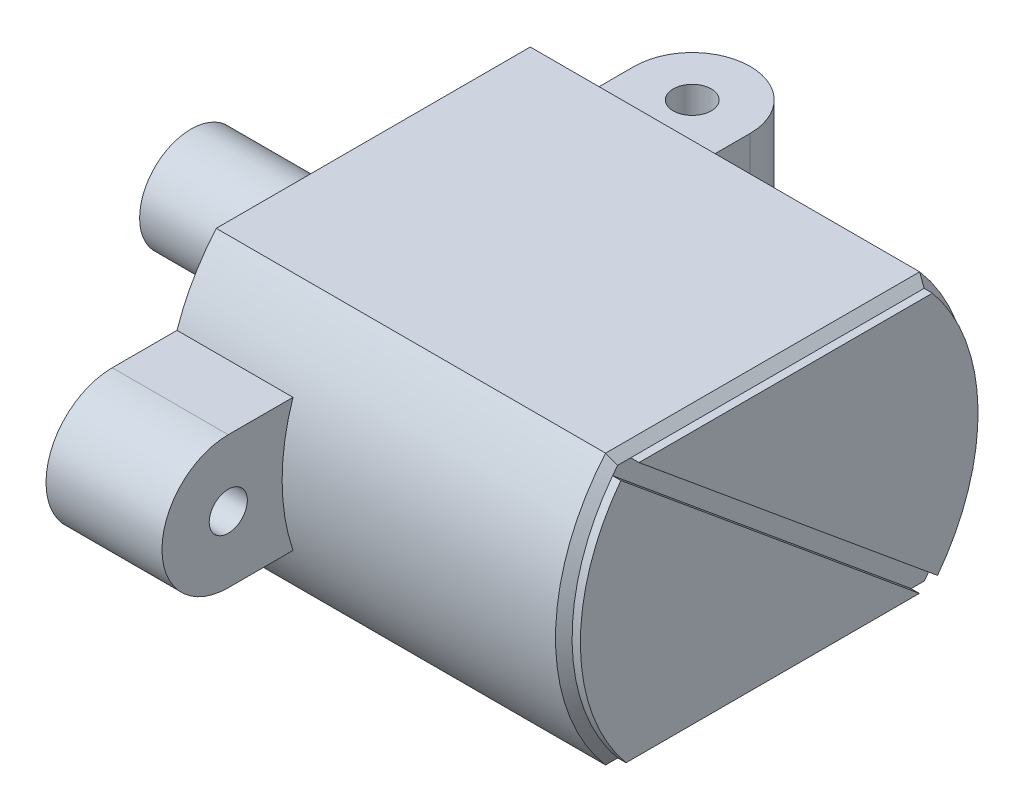
ISO-10303-21;
HEADER;
FILE_DESCRIPTION(('STEP AP214'),'2;1');
FILE_NAME('part.step','',(''),(''),'','','');
FILE_SCHEMA(('AUTOMOTIVE_DESIGN { 1 0 10303 214 1 1 1 1 }'));
ENDSEC;
DATA;
#1=APPLICATION_CONTEXT('core data for automotive mechanical design processes');
#2=APPLICATION_PROTOCOL_DEFINITION('international standard','automotive_design',2000,#1);
#3=PRODUCT_CONTEXT('',#1,'mechanical');
#4=PRODUCT('Part','Part','',(#3));
#5=PRODUCT_RELATED_PRODUCT_CATEGORY('part','',(#4));
#6=PRODUCT_DEFINITION_FORMATION('','',#4);
#7=PRODUCT_DEFINITION_CONTEXT('part definition',#1,'design');
#8=PRODUCT_DEFINITION('design','',#6,#7);
#9=PRODUCT_DEFINITION_SHAPE('','',#8);
#10=(LENGTH_UNIT() NAMED_UNIT(*) SI_UNIT(.MILLI.,.METRE.));
#11=(NAMED_UNIT(*) PLANE_ANGLE_UNIT() SI_UNIT($,.RADIAN.));
#12=(NAMED_UNIT(*) SI_UNIT($,.STERADIAN.) SOLID_ANGLE_UNIT());
#13=UNCERTAINTY_MEASURE_WITH_UNIT(LENGTH_MEASURE(1.E-05),#10,'distance_accuracy_value','');
#14=(GEOMETRIC_REPRESENTATION_CONTEXT(3) GLOBAL_UNCERTAINTY_ASSIGNED_CONTEXT((#13)) GLOBAL_UNIT_ASSIGNED_CONTEXT((#10,
#11,#12)) REPRESENTATION_CONTEXT('',''));
#15=CARTESIAN_POINT('',(0.,0.,0.));
#16=DIRECTION('',(0.,0.,1.));
#17=DIRECTION('',(1.,0.,0.));
#18=AXIS2_PLACEMENT_3D('',#15,#16,#17);
#19=CARTESIAN_POINT('',(24.,0.,0.));
#20=DIRECTION('',(1.,0.,0.));
#21=DIRECTION('',(0.,0.,-1.));
#22=AXIS2_PLACEMENT_3D('',#19,#20,#21);
#23=PLANE('',#22);
#24=CARTESIAN_POINT('',(24.,0.,0.));
#25=DIRECTION('',(1.,0.,0.));
#26=DIRECTION('',(0.,0.,-1.));
#27=AXIS2_PLACEMENT_3D('',#24,#25,#26);
#28=CIRCLE('',#27,12.);
#29=CARTESIAN_POINT('',(24.,-7.65,-9.24540426374099));
#30=VERTEX_POINT('',#29);
#31=CARTESIAN_POINT('',(24.,-7.25813131262377,-9.55612525287892));
#32=VERTEX_POINT('',#31);
#33=EDGE_CURVE('E323',#30,#32,#28,.T.);
#34=ORIENTED_EDGE('',*,*,#33,.T.);
#35=DIRECTION('',(0.,-0.6375,-0.770450355311749));
#36=VECTOR('',#35,1.);
#37=CARTESIAN_POINT('',(24.,7.65,8.4610905382508));
#38=LINE('',#37,#36);
#39=CARTESIAN_POINT('',(24.,7.65,8.4610905382508));
#40=VERTEX_POINT('',#39);
#41=EDGE_CURVE('E192',#40,#32,#38,.T.);
#42=ORIENTED_EDGE('',*,*,#41,.F.);
#43=DIRECTION('',(0.,0.,1.));
#44=VECTOR('',#43,1.);
#45=CARTESIAN_POINT('',(24.,7.65,9.47773707168542));
#46=LINE('',#45,#44);
#47=CARTESIAN_POINT('',(24.,7.65,9.24540426374099));
#48=VERTEX_POINT('',#47);
#49=EDGE_CURVE('E325',#40,#48,#46,.T.);
#50=ORIENTED_EDGE('',*,*,#49,.T.);
#51=CARTESIAN_POINT('',(24.,0.,0.));
#52=DIRECTION('',(1.,0.,0.));
#53=DIRECTION('',(0.,0.,-1.));
#54=AXIS2_PLACEMENT_3D('',#51,#52,#53);
#55=CIRCLE('',#54,12.);
#56=CARTESIAN_POINT('',(24.,7.25813131262377,9.55612525287893));
#57=VERTEX_POINT('',#56);
#58=EDGE_CURVE('E317',#48,#57,#55,.T.);
#59=ORIENTED_EDGE('',*,*,#58,.T.);
#60=DIRECTION('',(0.,0.6375,0.770450355311749));
#61=VECTOR('',#60,1.);
#62=CARTESIAN_POINT('',(24.,7.25813131262377,9.55612525287893));
#63=LINE('',#62,#61);
#64=CARTESIAN_POINT('',(24.,-7.65,-8.4610905382508));
#65=VERTEX_POINT('',#64);
#66=EDGE_CURVE('E66',#65,#57,#63,.T.);
#67=ORIENTED_EDGE('',*,*,#66,.F.);
#68=DIRECTION('',(0.,0.,-1.));
#69=VECTOR('',#68,1.);
#70=CARTESIAN_POINT('',(24.,-7.65,-9.47773707168541));
#71=LINE('',#70,#69);
#72=EDGE_CURVE('E319',#65,#30,#71,.T.);
#73=ORIENTED_EDGE('',*,*,#72,.T.);
#74=EDGE_LOOP('',(#34,#42,#50,#59,#67,#73));
#75=FACE_BOUND('',#74,.T.);
#76=ADVANCED_FACE('F36',(#75),#23,.T.);
#77=CARTESIAN_POINT('',(24.,0.,0.));
#78=DIRECTION('',(-1.,0.,0.));
#79=DIRECTION('',(0.,0.,1.));
#80=AXIS2_PLACEMENT_3D('',#77,#78,#79);
#81=CYLINDRICAL_SURFACE('',#80,12.5);
#82=DIRECTION('',(-1.,0.,0.));
#83=VECTOR('',#82,1.);
#84=CARTESIAN_POINT('',(24.,-8.15,9.47773707168542));
#85=LINE('',#84,#83);
#86=CARTESIAN_POINT('',(23.5,-8.15,9.47773707168542));
#87=VERTEX_POINT('',#86);
#88=CARTESIAN_POINT('',(0.,-8.15,9.47773707168542));
#89=VERTEX_POINT('',#88);
#90=EDGE_CURVE('E306',#87,#89,#85,.T.);
#91=ORIENTED_EDGE('',*,*,#90,.F.);
#92=CARTESIAN_POINT('',(23.5,0.,0.));
#93=DIRECTION('',(1.,0.,0.));
#94=DIRECTION('',(0.,0.,-1.));
#95=AXIS2_PLACEMENT_3D('',#92,#93,#94);
#96=CIRCLE('',#95,12.5);
#97=CARTESIAN_POINT('',(23.5,8.15,9.47773707168542));
#98=VERTEX_POINT('',#97);
#99=EDGE_CURVE('E11',#87,#98,#96,.F.);
#100=ORIENTED_EDGE('',*,*,#99,.T.);
#101=DIRECTION('',(-1.,0.,0.));
#102=VECTOR('',#101,1.);
#103=CARTESIAN_POINT('',(24.,8.15,9.47773707168542));
#104=LINE('',#103,#102);
#105=CARTESIAN_POINT('',(0.,8.15,9.47773707168542));
#106=VERTEX_POINT('',#105);
#107=EDGE_CURVE('E300',#98,#106,#104,.T.);
#108=ORIENTED_EDGE('',*,*,#107,.T.);
#109=CARTESIAN_POINT('',(0.,0.,0.));
#110=DIRECTION('',(1.,0.,0.));
#111=DIRECTION('',(0.,0.,-1.));
#112=AXIS2_PLACEMENT_3D('',#109,#110,#111);
#113=CIRCLE('',#112,12.5);
#114=CARTESIAN_POINT('',(0.,4.,11.842719282327));
#115=VERTEX_POINT('',#114);
#116=EDGE_CURVE('E289',#106,#115,#113,.T.);
#117=ORIENTED_EDGE('',*,*,#116,.T.);
#118=DIRECTION('',(-1.,0.,0.));
#119=VECTOR('',#118,1.);
#120=CARTESIAN_POINT('',(24.,4.,11.842719282327));
#121=LINE('',#120,#119);
#122=CARTESIAN_POINT('',(7.,4.,11.842719282327));
#123=VERTEX_POINT('',#122);
#124=EDGE_CURVE('E286',#115,#123,#121,.F.);
#125=ORIENTED_EDGE('',*,*,#124,.T.);
#126=CARTESIAN_POINT('',(7.,0.,0.));
#127=DIRECTION('',(-1.,0.,0.));
#128=DIRECTION('',(0.,0.,1.));
#129=AXIS2_PLACEMENT_3D('',#126,#127,#128);
#130=CIRCLE('',#129,12.5);
#131=CARTESIAN_POINT('',(7.,-4.,11.842719282327));
#132=VERTEX_POINT('',#131);
#133=EDGE_CURVE('E308',#132,#123,#130,.T.);
#134=ORIENTED_EDGE('',*,*,#133,.F.);
#135=DIRECTION('',(-1.,0.,0.));
#136=VECTOR('',#135,1.);
#137=CARTESIAN_POINT('',(24.,-4.,11.842719282327));
#138=LINE('',#137,#136);
#139=CARTESIAN_POINT('',(0.,-4.,11.842719282327));
#140=VERTEX_POINT('',#139);
#141=EDGE_CURVE('E281',#132,#140,#138,.T.);
#142=ORIENTED_EDGE('',*,*,#141,.T.);
#143=EDGE_CURVE('E288',#140,#89,#113,.T.);
#144=ORIENTED_EDGE('',*,*,#143,.T.);
#145=EDGE_LOOP('',(#91,#100,#108,#117,#125,#134,#142,#144));
#146=FACE_BOUND('',#145,.T.);
#147=ADVANCED_FACE('F369',(#146),#81,.T.);
#148=CARTESIAN_POINT('',(24.,-8.15,-9.47773707168541));
#149=DIRECTION('',(0.,1.,0.));
#150=DIRECTION('',(0.,0.,1.));
#151=AXIS2_PLACEMENT_3D('',#148,#149,#150);
#152=PLANE('',#151);
#153=DIRECTION('',(-1.,0.,0.));
#154=VECTOR('',#153,1.);
#155=CARTESIAN_POINT('',(24.,-8.15,-9.47773707168541));
#156=LINE('',#155,#154);
#157=CARTESIAN_POINT('',(23.5,-8.15,-9.47773707168541));
#158=VERTEX_POINT('',#157);
#159=CARTESIAN_POINT('',(0.,-8.15,-9.47773707168541));
#160=VERTEX_POINT('',#159);
#161=EDGE_CURVE('E304',#158,#160,#156,.T.);
#162=ORIENTED_EDGE('',*,*,#161,.F.);
#163=DIRECTION('',(0.,0.,1.));
#164=VECTOR('',#163,1.);
#165=CARTESIAN_POINT('',(23.5,-8.15,9.47773707168542));
#166=LINE('',#165,#164);
#167=EDGE_CURVE('E50',#158,#87,#166,.T.);
#168=ORIENTED_EDGE('',*,*,#167,.T.);
#169=ORIENTED_EDGE('',*,*,#90,.T.);
#170=DIRECTION('',(0.,0.,-1.));
#171=VECTOR('',#170,1.);
#172=CARTESIAN_POINT('',(0.,-8.15,-9.47773707168541));
#173=LINE('',#172,#171);
#174=EDGE_CURVE('E291',#89,#160,#173,.T.);
#175=ORIENTED_EDGE('',*,*,#174,.T.);
#176=EDGE_LOOP('',(#162,#168,#169,#175));
#177=FACE_BOUND('',#176,.T.);
#178=ADVANCED_FACE('F374',(#177),#152,.F.);
#179=CARTESIAN_POINT('',(24.,0.,0.));
#180=DIRECTION('',(-1.,0.,0.));
#181=DIRECTION('',(0.,0.,1.));
#182=AXIS2_PLACEMENT_3D('',#179,#180,#181);
#183=CYLINDRICAL_SURFACE('',#182,12.5);
#184=DIRECTION('',(-1.,0.,0.));
#185=VECTOR('',#184,1.);
#186=CARTESIAN_POINT('',(24.,8.15,-9.47773707168541));
#187=LINE('',#186,#185);
#188=CARTESIAN_POINT('',(23.5,8.15,-9.47773707168541));
#189=VERTEX_POINT('',#188);
#190=CARTESIAN_POINT('',(0.,8.15,-9.47773707168541));
#191=VERTEX_POINT('',#190);
#192=EDGE_CURVE('E302',#189,#191,#187,.T.);
#193=ORIENTED_EDGE('',*,*,#192,.F.);
#194=CARTESIAN_POINT('',(23.5,0.,0.));
#195=DIRECTION('',(1.,0.,0.));
#196=DIRECTION('',(0.,0.,-1.));
#197=AXIS2_PLACEMENT_3D('',#194,#195,#196);
#198=CIRCLE('',#197,12.5);
#199=EDGE_CURVE('E331',#189,#158,#198,.F.);
#200=ORIENTED_EDGE('',*,*,#199,.T.);
#201=ORIENTED_EDGE('',*,*,#161,.T.);
#202=CARTESIAN_POINT('',(0.,0.,0.));
#203=DIRECTION('',(1.,0.,0.));
#204=DIRECTION('',(0.,0.,-1.));
#205=AXIS2_PLACEMENT_3D('',#202,#203,#204);
#206=CIRCLE('',#205,12.5);
#207=CARTESIAN_POINT('',(0.,-4.,-11.842719282327));
#208=VERTEX_POINT('',#207);
#209=EDGE_CURVE('E295',#160,#208,#206,.T.);
#210=ORIENTED_EDGE('',*,*,#209,.T.);
#211=DIRECTION('',(-1.,0.,0.));
#212=VECTOR('',#211,1.);
#213=CARTESIAN_POINT('',(24.,-4.,-11.842719282327));
#214=LINE('',#213,#212);
#215=CARTESIAN_POINT('',(7.,-4.,-11.842719282327));
#216=VERTEX_POINT('',#215);
#217=EDGE_CURVE('E250',#216,#208,#214,.T.);
#218=ORIENTED_EDGE('',*,*,#217,.F.);
#219=CARTESIAN_POINT('',(7.,0.,0.));
#220=DIRECTION('',(-1.,0.,0.));
#221=DIRECTION('',(0.,0.,1.));
#222=AXIS2_PLACEMENT_3D('',#219,#220,#221);
#223=CIRCLE('',#222,12.5);
#224=CARTESIAN_POINT('',(7.,4.,-11.842719282327));
#225=VERTEX_POINT('',#224);
#226=EDGE_CURVE('E311',#225,#216,#223,.T.);
#227=ORIENTED_EDGE('',*,*,#226,.F.);
#228=DIRECTION('',(-1.,0.,0.));
#229=VECTOR('',#228,1.);
#230=CARTESIAN_POINT('',(24.,4.,-11.842719282327));
#231=LINE('',#230,#229);
#232=CARTESIAN_POINT('',(0.,4.,-11.842719282327));
#233=VERTEX_POINT('',#232);
#234=EDGE_CURVE('E253',#225,#233,#231,.T.);
#235=ORIENTED_EDGE('',*,*,#234,.T.);
#236=EDGE_CURVE('E294',#233,#191,#206,.T.);
#237=ORIENTED_EDGE('',*,*,#236,.T.);
#238=EDGE_LOOP('',(#193,#200,#201,#210,#218,#227,#235,#237));
#239=FACE_BOUND('',#238,.T.);
#240=ADVANCED_FACE('F388',(#239),#183,.T.);
#241=CARTESIAN_POINT('',(24.,8.15,-9.47773707168541));
#242=DIRECTION('',(0.,-1.,0.));
#243=DIRECTION('',(0.,0.,-1.));
#244=AXIS2_PLACEMENT_3D('',#241,#242,#243);
#245=PLANE('',#244);
#246=ORIENTED_EDGE('',*,*,#107,.F.);
#247=DIRECTION('',(0.,0.,-1.));
#248=VECTOR('',#247,1.);
#249=CARTESIAN_POINT('',(23.5,8.15,-9.47773707168541));
#250=LINE('',#249,#248);
#251=EDGE_CURVE('E328',#98,#189,#250,.T.);
#252=ORIENTED_EDGE('',*,*,#251,.T.);
#253=ORIENTED_EDGE('',*,*,#192,.T.);
#254=DIRECTION('',(0.,0.,1.));
#255=VECTOR('',#254,1.);
#256=CARTESIAN_POINT('',(0.,8.15,-9.47773707168541));
#257=LINE('',#256,#255);
#258=EDGE_CURVE('E297',#191,#106,#257,.T.);
#259=ORIENTED_EDGE('',*,*,#258,.T.);
#260=EDGE_LOOP('',(#246,#252,#253,#259));
#261=FACE_BOUND('',#260,.T.);
#262=ADVANCED_FACE('F384',(#261),#245,.F.);
#263=CARTESIAN_POINT('',(0.,0.,0.));
#264=DIRECTION('',(1.,0.,0.));
#265=DIRECTION('',(0.,0.,-1.));
#266=AXIS2_PLACEMENT_3D('',#263,#264,#265);
#267=PLANE('',#266);
#268=CARTESIAN_POINT('',(0.,0.,0.));
#269=DIRECTION('',(1.,0.,0.));
#270=DIRECTION('',(0.,0.,-1.));
#271=AXIS2_PLACEMENT_3D('',#268,#269,#270);
#272=CIRCLE('',#271,3.1);
#273=CARTESIAN_POINT('',(0.,0.,-3.1));
#274=VERTEX_POINT('',#273);
#275=EDGE_CURVE('E314',#274,#274,#272,.F.);
#276=ORIENTED_EDGE('',*,*,#275,.F.);
#277=EDGE_LOOP('',(#276));
#278=FACE_BOUND('',#277,.T.);
#279=ORIENTED_EDGE('',*,*,#236,.F.);
#280=DIRECTION('',(0.,0.,1.));
#281=VECTOR('',#280,1.);
#282=CARTESIAN_POINT('',(0.,4.,0.));
#283=LINE('',#282,#281);
#284=CARTESIAN_POINT('',(0.,4.,-15.75));
#285=VERTEX_POINT('',#284);
#286=EDGE_CURVE('E236',#285,#233,#283,.T.);
#287=ORIENTED_EDGE('',*,*,#286,.F.);
#288=DIRECTION('',(0.,-1.,0.));
#289=VECTOR('',#288,1.);
#290=CARTESIAN_POINT('',(0.,4.,-15.75));
#291=LINE('',#290,#289);
#292=CARTESIAN_POINT('',(0.,-4.,-15.75));
#293=VERTEX_POINT('',#292);
#294=EDGE_CURVE('E239',#285,#293,#291,.T.);
#295=ORIENTED_EDGE('',*,*,#294,.T.);
#296=DIRECTION('',(0.,0.,1.));
#297=VECTOR('',#296,1.);
#298=CARTESIAN_POINT('',(0.,-4.,0.));
#299=LINE('',#298,#297);
#300=EDGE_CURVE('E234',#293,#208,#299,.T.);
#301=ORIENTED_EDGE('',*,*,#300,.T.);
#302=ORIENTED_EDGE('',*,*,#209,.F.);
#303=ORIENTED_EDGE('',*,*,#174,.F.);
#304=ORIENTED_EDGE('',*,*,#143,.F.);
#305=DIRECTION('',(0.,0.,1.));
#306=VECTOR('',#305,1.);
#307=CARTESIAN_POINT('',(0.,-4.,0.));
#308=LINE('',#307,#306);
#309=CARTESIAN_POINT('',(0.,-4.,15.75));
#310=VERTEX_POINT('',#309);
#311=EDGE_CURVE('E260',#140,#310,#308,.T.);
#312=ORIENTED_EDGE('',*,*,#311,.T.);
#313=CARTESIAN_POINT('',(0.,0.,15.75));
#314=DIRECTION('',(-1.,0.,0.));
#315=DIRECTION('',(0.,0.,1.));
#316=AXIS2_PLACEMENT_3D('',#313,#314,#315);
#317=CIRCLE('',#316,4.);
#318=CARTESIAN_POINT('',(0.,4.,15.75));
#319=VERTEX_POINT('',#318);
#320=EDGE_CURVE('E274',#310,#319,#317,.T.);
#321=ORIENTED_EDGE('',*,*,#320,.T.);
#322=DIRECTION('',(0.,0.,-1.));
#323=VECTOR('',#322,1.);
#324=CARTESIAN_POINT('',(0.,4.,0.));
#325=LINE('',#324,#323);
#326=EDGE_CURVE('E266',#319,#115,#325,.T.);
#327=ORIENTED_EDGE('',*,*,#326,.T.);
#328=ORIENTED_EDGE('',*,*,#116,.F.);
#329=ORIENTED_EDGE('',*,*,#258,.F.);
#330=EDGE_LOOP('',(#279,#287,#295,#301,#302,#303,#304,#312,#321,#327,#328,#329));
#331=FACE_BOUND('',#330,.T.);
#332=CARTESIAN_POINT('',(0.,0.,15.75));
#333=DIRECTION('',(-1.,0.,0.));
#334=DIRECTION('',(0.,0.,1.));
#335=AXIS2_PLACEMENT_3D('',#332,#333,#334);
#336=CIRCLE('',#335,1.15);
#337=CARTESIAN_POINT('',(0.,0.,16.9));
#338=VERTEX_POINT('',#337);
#339=EDGE_CURVE('E256',#338,#338,#336,.T.);
#340=ORIENTED_EDGE('',*,*,#339,.F.);
#341=EDGE_LOOP('',(#340));
#342=FACE_BOUND('',#341,.T.);
#343=ADVANCED_FACE('F380',(#278,#331,#342),#267,.F.);
#344=CARTESIAN_POINT('',(7.,4.,0.));
#345=DIRECTION('',(0.,1.,0.));
#346=DIRECTION('',(0.,0.,1.));
#347=AXIS2_PLACEMENT_3D('',#344,#345,#346);
#348=PLANE('',#347);
#349=ORIENTED_EDGE('',*,*,#124,.F.);
#350=ORIENTED_EDGE('',*,*,#326,.F.);
#351=DIRECTION('',(-1.,0.,0.));
#352=VECTOR('',#351,1.);
#353=CARTESIAN_POINT('',(7.,4.,15.75));
#354=LINE('',#353,#352);
#355=CARTESIAN_POINT('',(7.,4.,15.75));
#356=VERTEX_POINT('',#355);
#357=EDGE_CURVE('E279',#356,#319,#354,.T.);
#358=ORIENTED_EDGE('',*,*,#357,.F.);
#359=DIRECTION('',(0.,0.,-1.));
#360=VECTOR('',#359,1.);
#361=CARTESIAN_POINT('',(7.,4.,0.));
#362=LINE('',#361,#360);
#363=EDGE_CURVE('E269',#356,#123,#362,.T.);
#364=ORIENTED_EDGE('',*,*,#363,.T.);
#365=EDGE_LOOP('',(#349,#350,#358,#364));
#366=FACE_BOUND('',#365,.T.);
#367=ADVANCED_FACE('F383',(#366),#348,.T.);
#368=CARTESIAN_POINT('',(7.,-4.,0.));
#369=DIRECTION('',(0.,-1.,0.));
#370=DIRECTION('',(0.,0.,-1.));
#371=AXIS2_PLACEMENT_3D('',#368,#369,#370);
#372=PLANE('',#371);
#373=ORIENTED_EDGE('',*,*,#141,.F.);
#374=DIRECTION('',(0.,0.,1.));
#375=VECTOR('',#374,1.);
#376=CARTESIAN_POINT('',(7.,-4.,0.));
#377=LINE('',#376,#375);
#378=CARTESIAN_POINT('',(7.,-4.,15.75));
#379=VERTEX_POINT('',#378);
#380=EDGE_CURVE('E263',#132,#379,#377,.T.);
#381=ORIENTED_EDGE('',*,*,#380,.T.);
#382=DIRECTION('',(-1.,0.,0.));
#383=VECTOR('',#382,1.);
#384=CARTESIAN_POINT('',(7.,-4.,15.75));
#385=LINE('',#384,#383);
#386=EDGE_CURVE('E272',#379,#310,#385,.T.);
#387=ORIENTED_EDGE('',*,*,#386,.T.);
#388=ORIENTED_EDGE('',*,*,#311,.F.);
#389=EDGE_LOOP('',(#373,#381,#387,#388));
#390=FACE_BOUND('',#389,.T.);
#391=ADVANCED_FACE('F378',(#390),#372,.T.);
#392=CARTESIAN_POINT('',(7.,0.,15.75));
#393=DIRECTION('',(-1.,0.,0.));
#394=DIRECTION('',(0.,0.,1.));
#395=AXIS2_PLACEMENT_3D('',#392,#393,#394);
#396=CYLINDRICAL_SURFACE('',#395,4.);
#397=ORIENTED_EDGE('',*,*,#320,.F.);
#398=ORIENTED_EDGE('',*,*,#386,.F.);
#399=CARTESIAN_POINT('',(7.,0.,15.75));
#400=DIRECTION('',(-1.,0.,0.));
#401=DIRECTION('',(0.,0.,1.));
#402=AXIS2_PLACEMENT_3D('',#399,#400,#401);
#403=CIRCLE('',#402,4.);
#404=EDGE_CURVE('E265',#379,#356,#403,.T.);
#405=ORIENTED_EDGE('',*,*,#404,.T.);
#406=ORIENTED_EDGE('',*,*,#357,.T.);
#407=EDGE_LOOP('',(#397,#398,#405,#406));
#408=FACE_BOUND('',#407,.T.);
#409=ADVANCED_FACE('F497',(#408),#396,.T.);
#410=CARTESIAN_POINT('',(7.,0.,0.));
#411=DIRECTION('',(-1.,0.,0.));
#412=DIRECTION('',(0.,0.,1.));
#413=AXIS2_PLACEMENT_3D('',#410,#411,#412);
#414=PLANE('',#413);
#415=CARTESIAN_POINT('',(7.,0.,15.75));
#416=DIRECTION('',(-1.,0.,0.));
#417=DIRECTION('',(0.,0.,1.));
#418=AXIS2_PLACEMENT_3D('',#415,#416,#417);
#419=CIRCLE('',#418,1.15);
#420=CARTESIAN_POINT('',(7.,0.,16.9));
#421=VERTEX_POINT('',#420);
#422=EDGE_CURVE('E257',#421,#421,#419,.T.);
#423=ORIENTED_EDGE('',*,*,#422,.T.);
#424=EDGE_LOOP('',(#423));
#425=FACE_BOUND('',#424,.T.);
#426=ORIENTED_EDGE('',*,*,#380,.F.);
#427=ORIENTED_EDGE('',*,*,#133,.T.);
#428=ORIENTED_EDGE('',*,*,#363,.F.);
#429=ORIENTED_EDGE('',*,*,#404,.F.);
#430=EDGE_LOOP('',(#426,#427,#428,#429));
#431=FACE_BOUND('',#430,.T.);
#432=ADVANCED_FACE('F451',(#425,#431),#414,.F.);
#433=CARTESIAN_POINT('',(7.,0.,15.75));
#434=DIRECTION('',(-1.,0.,0.));
#435=DIRECTION('',(0.,0.,1.));
#436=AXIS2_PLACEMENT_3D('',#433,#434,#435);
#437=CYLINDRICAL_SURFACE('',#436,1.15);
#438=ORIENTED_EDGE('',*,*,#422,.F.);
#439=EDGE_LOOP('',(#438));
#440=FACE_BOUND('',#439,.T.);
#441=ORIENTED_EDGE('',*,*,#339,.T.);
#442=EDGE_LOOP('',(#441));
#443=FACE_BOUND('',#442,.T.);
#444=ADVANCED_FACE('F475',(#440,#443),#437,.F.);
#445=CARTESIAN_POINT('',(3.5,4.,0.));
#446=DIRECTION('',(0.,1.,0.));
#447=DIRECTION('',(0.,0.,1.));
#448=AXIS2_PLACEMENT_3D('',#445,#446,#447);
#449=PLANE('',#448);
#450=CARTESIAN_POINT('',(3.5,4.,-15.75));
#451=DIRECTION('',(0.,1.,0.));
#452=DIRECTION('',(0.,0.,1.));
#453=AXIS2_PLACEMENT_3D('',#450,#451,#452);
#454=CIRCLE('',#453,1.15);
#455=CARTESIAN_POINT('',(3.5,4.,-14.6));
#456=VERTEX_POINT('',#455);
#457=EDGE_CURVE('E225',#456,#456,#454,.T.);
#458=ORIENTED_EDGE('',*,*,#457,.F.);
#459=EDGE_LOOP('',(#458));
#460=FACE_BOUND('',#459,.T.);
#461=ORIENTED_EDGE('',*,*,#234,.F.);
#462=DIRECTION('',(0.,0.,-1.));
#463=VECTOR('',#462,1.);
#464=CARTESIAN_POINT('',(7.,4.,0.));
#465=LINE('',#464,#463);
#466=CARTESIAN_POINT('',(7.,4.,-15.75));
#467=VERTEX_POINT('',#466);
#468=EDGE_CURVE('E231',#225,#467,#465,.T.);
#469=ORIENTED_EDGE('',*,*,#468,.T.);
#470=CARTESIAN_POINT('',(3.5,4.,-15.75));
#471=DIRECTION('',(0.,1.,0.));
#472=DIRECTION('',(0.,0.,1.));
#473=AXIS2_PLACEMENT_3D('',#470,#471,#472);
#474=CIRCLE('',#473,3.5);
#475=EDGE_CURVE('E233',#467,#285,#474,.T.);
#476=ORIENTED_EDGE('',*,*,#475,.T.);
#477=ORIENTED_EDGE('',*,*,#286,.T.);
#478=EDGE_LOOP('',(#461,#469,#476,#477));
#479=FACE_BOUND('',#478,.T.);
#480=ADVANCED_FACE('F473',(#460,#479),#449,.T.);
#481=CARTESIAN_POINT('',(3.5,-4.,0.));
#482=DIRECTION('',(0.,1.,0.));
#483=DIRECTION('',(0.,0.,1.));
#484=AXIS2_PLACEMENT_3D('',#481,#482,#483);
#485=PLANE('',#484);
#486=CARTESIAN_POINT('',(3.5,-4.,-15.75));
#487=DIRECTION('',(0.,1.,0.));
#488=DIRECTION('',(0.,0.,1.));
#489=AXIS2_PLACEMENT_3D('',#486,#487,#488);
#490=CIRCLE('',#489,1.15);
#491=CARTESIAN_POINT('',(3.5,-4.,-14.6));
#492=VERTEX_POINT('',#491);
#493=EDGE_CURVE('E224',#492,#492,#490,.T.);
#494=ORIENTED_EDGE('',*,*,#493,.T.);
#495=EDGE_LOOP('',(#494));
#496=FACE_BOUND('',#495,.T.);
#497=DIRECTION('',(0.,0.,-1.));
#498=VECTOR('',#497,1.);
#499=CARTESIAN_POINT('',(7.,-4.,0.));
#500=LINE('',#499,#498);
#501=CARTESIAN_POINT('',(7.,-4.,-15.75));
#502=VERTEX_POINT('',#501);
#503=EDGE_CURVE('E228',#216,#502,#500,.T.);
#504=ORIENTED_EDGE('',*,*,#503,.F.);
#505=ORIENTED_EDGE('',*,*,#217,.T.);
#506=ORIENTED_EDGE('',*,*,#300,.F.);
#507=CARTESIAN_POINT('',(3.5,-4.,-15.75));
#508=DIRECTION('',(0.,1.,0.));
#509=DIRECTION('',(0.,0.,1.));
#510=AXIS2_PLACEMENT_3D('',#507,#508,#509);
#511=CIRCLE('',#510,3.5);
#512=EDGE_CURVE('E241',#502,#293,#511,.T.);
#513=ORIENTED_EDGE('',*,*,#512,.F.);
#514=EDGE_LOOP('',(#504,#505,#506,#513));
#515=FACE_BOUND('',#514,.T.);
#516=ADVANCED_FACE('F460',(#496,#515),#485,.F.);
#517=CARTESIAN_POINT('',(7.,4.,0.));
#518=DIRECTION('',(-1.,0.,0.));
#519=DIRECTION('',(0.,0.,1.));
#520=AXIS2_PLACEMENT_3D('',#517,#518,#519);
#521=PLANE('',#520);
#522=ORIENTED_EDGE('',*,*,#468,.F.);
#523=ORIENTED_EDGE('',*,*,#226,.T.);
#524=ORIENTED_EDGE('',*,*,#503,.T.);
#525=DIRECTION('',(0.,-1.,0.));
#526=VECTOR('',#525,1.);
#527=CARTESIAN_POINT('',(7.,4.,-15.75));
#528=LINE('',#527,#526);
#529=EDGE_CURVE('E247',#467,#502,#528,.T.);
#530=ORIENTED_EDGE('',*,*,#529,.F.);
#531=EDGE_LOOP('',(#522,#523,#524,#530));
#532=FACE_BOUND('',#531,.T.);
#533=ADVANCED_FACE('F465',(#532),#521,.F.);
#534=CARTESIAN_POINT('',(3.5,4.,-15.75));
#535=DIRECTION('',(0.,-1.,0.));
#536=DIRECTION('',(0.,0.,-1.));
#537=AXIS2_PLACEMENT_3D('',#534,#535,#536);
#538=CYLINDRICAL_SURFACE('',#537,3.5);
#539=ORIENTED_EDGE('',*,*,#512,.T.);
#540=ORIENTED_EDGE('',*,*,#294,.F.);
#541=ORIENTED_EDGE('',*,*,#475,.F.);
#542=ORIENTED_EDGE('',*,*,#529,.T.);
#543=EDGE_LOOP('',(#539,#540,#541,#542));
#544=FACE_BOUND('',#543,.T.);
#545=ADVANCED_FACE('F468',(#544),#538,.T.);
#546=CARTESIAN_POINT('',(3.5,4.,-15.75));
#547=DIRECTION('',(0.,-1.,0.));
#548=DIRECTION('',(0.,0.,-1.));
#549=AXIS2_PLACEMENT_3D('',#546,#547,#548);
#550=CYLINDRICAL_SURFACE('',#549,1.15);
#551=ORIENTED_EDGE('',*,*,#457,.T.);
#552=EDGE_LOOP('',(#551));
#553=FACE_BOUND('',#552,.T.);
#554=ORIENTED_EDGE('',*,*,#493,.F.);
#555=EDGE_LOOP('',(#554));
#556=FACE_BOUND('',#555,.T.);
#557=ADVANCED_FACE('F488',(#553,#556),#550,.F.);
#558=CARTESIAN_POINT('',(-11.,0.,0.));
#559=DIRECTION('',(1.,0.,0.));
#560=DIRECTION('',(0.,0.,-1.));
#561=AXIS2_PLACEMENT_3D('',#558,#559,#560);
#562=CYLINDRICAL_SURFACE('',#561,3.1);
#563=CARTESIAN_POINT('',(-11.,0.,0.));
#564=DIRECTION('',(-1.,0.,0.));
#565=DIRECTION('',(0.,0.,1.));
#566=AXIS2_PLACEMENT_3D('',#563,#564,#565);
#567=CIRCLE('',#566,3.1);
#568=CARTESIAN_POINT('',(-11.,0.,3.1));
#569=VERTEX_POINT('',#568);
#570=EDGE_CURVE('E221',#569,#569,#567,.T.);
#571=ORIENTED_EDGE('',*,*,#570,.F.);
#572=EDGE_LOOP('',(#571));
#573=FACE_BOUND('',#572,.T.);
#574=ORIENTED_EDGE('',*,*,#275,.T.);
#575=EDGE_LOOP('',(#574));
#576=FACE_BOUND('',#575,.T.);
#577=ADVANCED_FACE('F543',(#573,#576),#562,.T.);
#578=CARTESIAN_POINT('',(-11.,0.,0.));
#579=DIRECTION('',(-1.,0.,0.));
#580=DIRECTION('',(0.,0.,1.));
#581=AXIS2_PLACEMENT_3D('',#578,#579,#580);
#582=PLANE('',#581);
#583=ORIENTED_EDGE('',*,*,#570,.T.);
#584=EDGE_LOOP('',(#583));
#585=FACE_BOUND('',#584,.T.);
#586=ADVANCED_FACE('F365',(#585),#582,.T.);
#587=CARTESIAN_POINT('',(24.,-7.65,0.));
#588=DIRECTION('',(0.707106781186547,-0.707106781186547,0.));
#589=DIRECTION('',(0.,0.,1.));
#590=AXIS2_PLACEMENT_3D('',#587,#588,#589);
#591=PLANE('',#590);
#592=CARTESIAN_POINT('',(23.5,-8.15,9.47773707168542));
#593=CARTESIAN_POINT('',(23.5834340822208,-8.06656591777924,9.43944860486621));
#594=CARTESIAN_POINT('',(23.6668177871225,-7.98318221287747,9.40094330548054));
#595=CARTESIAN_POINT('',(23.8334844538031,-7.81651554619688,9.32349903622566));
#596=CARTESIAN_POINT('',(23.916767415568,-7.73323258443198,9.28456006629651));
#597=CARTESIAN_POINT('',(24.,-7.65,9.24540426374099));
#598=B_SPLINE_CURVE_WITH_KNOTS('',3,(#592,#593,#594,#595,#596,#597),.UNSPECIFIED.,.F.,.F.,(4,2,
4),(0.,0.372149275296391,0.74429860201658),.UNSPECIFIED.);
#599=CARTESIAN_POINT('',(24.,-7.65,9.24540426374099));
#600=VERTEX_POINT('',#599);
#601=EDGE_CURVE('E405',#87,#600,#598,.T.);
#602=ORIENTED_EDGE('',*,*,#601,.F.);
#603=ORIENTED_EDGE('',*,*,#167,.F.);
#604=CARTESIAN_POINT('',(23.5,-8.15,-9.47773707168541));
#605=CARTESIAN_POINT('',(23.5834340822208,-8.06656591777924,-9.4394486048662));
#606=CARTESIAN_POINT('',(23.6668177871225,-7.98318221287747,-9.40094330548054));
#607=CARTESIAN_POINT('',(23.8334844538031,-7.81651554619688,-9.32349903622566));
#608=CARTESIAN_POINT('',(23.916767415568,-7.73323258443198,-9.28456006629651));
#609=CARTESIAN_POINT('',(24.,-7.65,-9.24540426374099));
#610=B_SPLINE_CURVE_WITH_KNOTS('',3,(#604,#605,#606,#607,#608,#609),.UNSPECIFIED.,.F.,.F.,(4,2,
4),(0.,0.372149275296391,0.74429860201658),.UNSPECIFIED.);
#611=EDGE_CURVE('E41',#30,#158,#610,.F.);
#612=ORIENTED_EDGE('',*,*,#611,.F.);
#613=ORIENTED_EDGE('',*,*,#72,.F.);
#614=EDGE_CURVE('E320',#600,#65,#71,.T.);
#615=ORIENTED_EDGE('',*,*,#614,.F.);
#616=EDGE_LOOP('',(#602,#603,#612,#613,#615));
#617=FACE_BOUND('',#616,.T.);
#618=ADVANCED_FACE('F38',(#617),#591,.T.);
#619=CARTESIAN_POINT('',(24.,0.,0.));
#620=DIRECTION('',(-1.,0.,0.));
#621=DIRECTION('',(0.,0.,1.));
#622=AXIS2_PLACEMENT_3D('',#619,#620,#621);
#623=CONICAL_SURFACE('',#622,12.,0.785398163397448);
#624=ORIENTED_EDGE('',*,*,#611,.T.);
#625=ORIENTED_EDGE('',*,*,#199,.F.);
#626=CARTESIAN_POINT('',(23.5,8.15,-9.47773707168541));
#627=CARTESIAN_POINT('',(23.5834340822208,8.06656591777924,-9.4394486048662));
#628=CARTESIAN_POINT('',(23.6668177871225,7.98318221287747,-9.40094330548054));
#629=CARTESIAN_POINT('',(23.8334844538031,7.81651554619688,-9.32349903622565));
#630=CARTESIAN_POINT('',(23.916767415568,7.73323258443198,-9.28456006629651));
#631=CARTESIAN_POINT('',(24.,7.65,-9.24540426374099));
#632=B_SPLINE_CURVE_WITH_KNOTS('',3,(#626,#627,#628,#629,#630,#631),.UNSPECIFIED.,.F.,.F.,(4,2,
4),(0.,0.372149275296392,0.74429860201658),.UNSPECIFIED.);
#633=CARTESIAN_POINT('',(24.,7.65,-9.24540426374099));
#634=VERTEX_POINT('',#633);
#635=EDGE_CURVE('E342',#634,#189,#632,.F.);
#636=ORIENTED_EDGE('',*,*,#635,.F.);
#637=CARTESIAN_POINT('',(24.,0.,0.));
#638=DIRECTION('',(1.,0.,0.));
#639=DIRECTION('',(0.,0.,-1.));
#640=AXIS2_PLACEMENT_3D('',#637,#638,#639);
#641=CIRCLE('',#640,12.);
#642=EDGE_CURVE('E58',#32,#634,#641,.T.);
#643=ORIENTED_EDGE('',*,*,#642,.F.);
#644=ORIENTED_EDGE('',*,*,#33,.F.);
#645=EDGE_LOOP('',(#624,#625,#636,#643,#644));
#646=FACE_BOUND('',#645,.T.);
#647=ADVANCED_FACE('F355',(#646),#623,.T.);
#648=CARTESIAN_POINT('',(24.,0.,0.));
#649=DIRECTION('',(-1.,0.,0.));
#650=DIRECTION('',(0.,0.,1.));
#651=AXIS2_PLACEMENT_3D('',#648,#649,#650);
#652=CONICAL_SURFACE('',#651,12.,0.785398163397448);
#653=ORIENTED_EDGE('',*,*,#601,.T.);
#654=CARTESIAN_POINT('',(24.,0.,0.));
#655=DIRECTION('',(1.,0.,0.));
#656=DIRECTION('',(0.,0.,-1.));
#657=AXIS2_PLACEMENT_3D('',#654,#655,#656);
#658=CIRCLE('',#657,12.);
#659=EDGE_CURVE('E195',#57,#600,#658,.T.);
#660=ORIENTED_EDGE('',*,*,#659,.F.);
#661=ORIENTED_EDGE('',*,*,#58,.F.);
#662=CARTESIAN_POINT('',(24.,7.65,9.24540426374099));
#663=CARTESIAN_POINT('',(23.916767415568,7.73323258443198,9.28456006629651));
#664=CARTESIAN_POINT('',(23.8334844538031,7.81651554619688,9.32349903622566));
#665=CARTESIAN_POINT('',(23.6668177871225,7.98318221287747,9.40094330548055));
#666=CARTESIAN_POINT('',(23.5834340822208,8.06656591777924,9.43944860486621));
#667=CARTESIAN_POINT('',(23.5,8.15,9.47773707168542));
#668=B_SPLINE_CURVE_WITH_KNOTS('',3,(#662,#663,#664,#665,#666,#667),.UNSPECIFIED.,.F.,.F.,(4,2,
4),(0.,0.372149326720192,0.744298602016582),.UNSPECIFIED.);
#669=EDGE_CURVE('E220',#98,#48,#668,.F.);
#670=ORIENTED_EDGE('',*,*,#669,.F.);
#671=ORIENTED_EDGE('',*,*,#99,.F.);
#672=EDGE_LOOP('',(#653,#660,#661,#670,#671));
#673=FACE_BOUND('',#672,.T.);
#674=ADVANCED_FACE('F347',(#673),#652,.T.);
#675=CARTESIAN_POINT('',(24.,7.65,0.));
#676=DIRECTION('',(0.707106781186547,0.707106781186547,0.));
#677=DIRECTION('',(0.,0.,-1.));
#678=AXIS2_PLACEMENT_3D('',#675,#676,#677);
#679=PLANE('',#678);
#680=ORIENTED_EDGE('',*,*,#635,.T.);
#681=ORIENTED_EDGE('',*,*,#251,.F.);
#682=ORIENTED_EDGE('',*,*,#669,.T.);
#683=ORIENTED_EDGE('',*,*,#49,.F.);
#684=EDGE_CURVE('E326',#634,#40,#46,.T.);
#685=ORIENTED_EDGE('',*,*,#684,.F.);
#686=EDGE_LOOP('',(#680,#681,#682,#683,#685));
#687=FACE_BOUND('',#686,.T.);
#688=ADVANCED_FACE('F350',(#687),#679,.T.);
#689=CARTESIAN_POINT('',(24.5,0.,0.));
#690=DIRECTION('',(-1.,0.,0.));
#691=DIRECTION('',(0.,0.,1.));
#692=AXIS2_PLACEMENT_3D('',#689,#690,#691);
#693=CYLINDRICAL_SURFACE('',#692,12.);
#694=ORIENTED_EDGE('',*,*,#659,.T.);
#695=DIRECTION('',(-1.,0.,0.));
#696=VECTOR('',#695,1.);
#697=CARTESIAN_POINT('',(24.5,-7.65,9.24540426374099));
#698=LINE('',#697,#696);
#699=CARTESIAN_POINT('',(24.5,-7.65,9.24540426374099));
#700=VERTEX_POINT('',#699);
#701=EDGE_CURVE('E217',#700,#600,#698,.T.);
#702=ORIENTED_EDGE('',*,*,#701,.F.);
#703=CARTESIAN_POINT('',(24.5,0.,0.));
#704=DIRECTION('',(1.,0.,0.));
#705=DIRECTION('',(0.,0.,-1.));
#706=AXIS2_PLACEMENT_3D('',#703,#704,#705);
#707=CIRCLE('',#706,12.);
#708=CARTESIAN_POINT('',(24.5,7.25813131262377,9.55612525287893));
#709=VERTEX_POINT('',#708);
#710=EDGE_CURVE('E203',#709,#700,#707,.T.);
#711=ORIENTED_EDGE('',*,*,#710,.F.);
#712=DIRECTION('',(-1.,0.,0.));
#713=VECTOR('',#712,1.);
#714=CARTESIAN_POINT('',(24.5,7.25813131262377,9.55612525287893));
#715=LINE('',#714,#713);
#716=EDGE_CURVE('E209',#709,#57,#715,.T.);
#717=ORIENTED_EDGE('',*,*,#716,.T.);
#718=EDGE_LOOP('',(#694,#702,#711,#717));
#719=FACE_BOUND('',#718,.T.);
#720=ADVANCED_FACE('F353',(#719),#693,.T.);
#721=CARTESIAN_POINT('',(24.5,-7.65,9.24540426374099));
#722=DIRECTION('',(0.,1.,0.));
#723=DIRECTION('',(0.,0.,1.));
#724=AXIS2_PLACEMENT_3D('',#721,#722,#723);
#725=PLANE('',#724);
#726=ORIENTED_EDGE('',*,*,#614,.T.);
#727=DIRECTION('',(-1.,0.,0.));
#728=VECTOR('',#727,1.);
#729=CARTESIAN_POINT('',(24.5,-7.65,-8.46109053825079));
#730=LINE('',#729,#728);
#731=CARTESIAN_POINT('',(24.5,-7.65,-8.46109053825079));
#732=VERTEX_POINT('',#731);
#733=EDGE_CURVE('E214',#732,#65,#730,.T.);
#734=ORIENTED_EDGE('',*,*,#733,.F.);
#735=DIRECTION('',(0.,0.,-1.));
#736=VECTOR('',#735,1.);
#737=CARTESIAN_POINT('',(24.5,-7.65,9.24540426374099));
#738=LINE('',#737,#736);
#739=EDGE_CURVE('E206',#700,#732,#738,.T.);
#740=ORIENTED_EDGE('',*,*,#739,.F.);
#741=ORIENTED_EDGE('',*,*,#701,.T.);
#742=EDGE_LOOP('',(#726,#734,#740,#741));
#743=FACE_BOUND('',#742,.T.);
#744=ADVANCED_FACE('F425',(#743),#725,.F.);
#745=CARTESIAN_POINT('',(24.5,7.25813131262377,9.55612525287893));
#746=DIRECTION('',(0.,-0.770450355311749,0.6375));
#747=DIRECTION('',(0.,-0.6375,-0.770450355311749));
#748=AXIS2_PLACEMENT_3D('',#745,#746,#747);
#749=PLANE('',#748);
#750=ORIENTED_EDGE('',*,*,#66,.T.);
#751=ORIENTED_EDGE('',*,*,#716,.F.);
#752=DIRECTION('',(0.,0.6375,0.770450355311749));
#753=VECTOR('',#752,1.);
#754=CARTESIAN_POINT('',(24.5,7.25813131262377,9.55612525287893));
#755=LINE('',#754,#753);
#756=EDGE_CURVE('E208',#732,#709,#755,.T.);
#757=ORIENTED_EDGE('',*,*,#756,.F.);
#758=ORIENTED_EDGE('',*,*,#733,.T.);
#759=EDGE_LOOP('',(#750,#751,#757,#758));
#760=FACE_BOUND('',#759,.T.);
#761=ADVANCED_FACE('F429',(#760),#749,.F.);
#762=CARTESIAN_POINT('',(24.5,0.,0.));
#763=DIRECTION('',(1.,0.,0.));
#764=DIRECTION('',(0.,0.,-1.));
#765=AXIS2_PLACEMENT_3D('',#762,#763,#764);
#766=PLANE('',#765);
#767=ORIENTED_EDGE('',*,*,#710,.T.);
#768=ORIENTED_EDGE('',*,*,#739,.T.);
#769=ORIENTED_EDGE('',*,*,#756,.T.);
#770=EDGE_LOOP('',(#767,#768,#769));
#771=FACE_BOUND('',#770,.T.);
#772=ADVANCED_FACE('F433',(#771),#766,.T.);
#773=CARTESIAN_POINT('',(24.5,0.,0.));
#774=DIRECTION('',(-1.,0.,0.));
#775=DIRECTION('',(0.,0.,1.));
#776=AXIS2_PLACEMENT_3D('',#773,#774,#775);
#777=CYLINDRICAL_SURFACE('',#776,12.);
#778=ORIENTED_EDGE('',*,*,#642,.T.);
#779=DIRECTION('',(-1.,0.,0.));
#780=VECTOR('',#779,1.);
#781=CARTESIAN_POINT('',(24.5,7.65,-9.24540426374098));
#782=LINE('',#781,#780);
#783=CARTESIAN_POINT('',(24.5,7.65,-9.24540426374098));
#784=VERTEX_POINT('',#783);
#785=EDGE_CURVE('E179',#784,#634,#782,.T.);
#786=ORIENTED_EDGE('',*,*,#785,.F.);
#787=CARTESIAN_POINT('',(24.5,0.,0.));
#788=DIRECTION('',(1.,0.,0.));
#789=DIRECTION('',(0.,0.,-1.));
#790=AXIS2_PLACEMENT_3D('',#787,#788,#789);
#791=CIRCLE('',#790,12.);
#792=CARTESIAN_POINT('',(24.5,-7.25813131262377,-9.55612525287892));
#793=VERTEX_POINT('',#792);
#794=EDGE_CURVE('E185',#793,#784,#791,.T.);
#795=ORIENTED_EDGE('',*,*,#794,.F.);
#796=DIRECTION('',(-1.,0.,0.));
#797=VECTOR('',#796,1.);
#798=CARTESIAN_POINT('',(24.5,-7.25813131262377,-9.55612525287892));
#799=LINE('',#798,#797);
#800=EDGE_CURVE('E199',#793,#32,#799,.T.);
#801=ORIENTED_EDGE('',*,*,#800,.T.);
#802=EDGE_LOOP('',(#778,#786,#795,#801));
#803=FACE_BOUND('',#802,.T.);
#804=ADVANCED_FACE('F194',(#803),#777,.T.);
#805=CARTESIAN_POINT('',(24.5,7.65,-9.24540426374098));
#806=DIRECTION('',(0.,-1.,0.));
#807=DIRECTION('',(0.,0.,-1.));
#808=AXIS2_PLACEMENT_3D('',#805,#806,#807);
#809=PLANE('',#808);
#810=ORIENTED_EDGE('',*,*,#684,.T.);
#811=DIRECTION('',(-1.,0.,0.));
#812=VECTOR('',#811,1.);
#813=CARTESIAN_POINT('',(24.5,7.65,8.4610905382508));
#814=LINE('',#813,#812);
#815=CARTESIAN_POINT('',(24.5,7.65,8.4610905382508));
#816=VERTEX_POINT('',#815);
#817=EDGE_CURVE('E181',#816,#40,#814,.T.);
#818=ORIENTED_EDGE('',*,*,#817,.F.);
#819=DIRECTION('',(0.,0.,1.));
#820=VECTOR('',#819,1.);
#821=CARTESIAN_POINT('',(24.5,7.65,-9.24540426374098));
#822=LINE('',#821,#820);
#823=EDGE_CURVE('E174',#784,#816,#822,.T.);
#824=ORIENTED_EDGE('',*,*,#823,.F.);
#825=ORIENTED_EDGE('',*,*,#785,.T.);
#826=EDGE_LOOP('',(#810,#818,#824,#825));
#827=FACE_BOUND('',#826,.T.);
#828=ADVANCED_FACE('F177',(#827),#809,.F.);
#829=CARTESIAN_POINT('',(24.5,7.65,8.4610905382508));
#830=DIRECTION('',(0.,0.770450355311749,-0.6375));
#831=DIRECTION('',(0.,0.6375,0.770450355311749));
#832=AXIS2_PLACEMENT_3D('',#829,#830,#831);
#833=PLANE('',#832);
#834=ORIENTED_EDGE('',*,*,#41,.T.);
#835=ORIENTED_EDGE('',*,*,#800,.F.);
#836=DIRECTION('',(0.,-0.6375,-0.770450355311749));
#837=VECTOR('',#836,1.);
#838=CARTESIAN_POINT('',(24.5,7.65,8.4610905382508));
#839=LINE('',#838,#837);
#840=EDGE_CURVE('E184',#816,#793,#839,.T.);
#841=ORIENTED_EDGE('',*,*,#840,.F.);
#842=ORIENTED_EDGE('',*,*,#817,.T.);
#843=EDGE_LOOP('',(#834,#835,#841,#842));
#844=FACE_BOUND('',#843,.T.);
#845=ADVANCED_FACE('F419',(#844),#833,.F.);
#846=CARTESIAN_POINT('',(24.5,0.,0.));
#847=DIRECTION('',(1.,0.,0.));
#848=DIRECTION('',(0.,0.,-1.));
#849=AXIS2_PLACEMENT_3D('',#846,#847,#848);
#850=PLANE('',#849);
#851=ORIENTED_EDGE('',*,*,#794,.T.);
#852=ORIENTED_EDGE('',*,*,#823,.T.);
#853=ORIENTED_EDGE('',*,*,#840,.T.);
#854=EDGE_LOOP('',(#851,#852,#853));
#855=FACE_BOUND('',#854,.T.);
#856=ADVANCED_FACE('F188',(#855),#850,.T.);
#857=CLOSED_SHELL('',(#76,#147,#178,#240,#262,#343,#367,#391,#409,#432,#444,#480,#516,#533,#545,
#557,#577,#586,#618,#647,#674,#688,#720,#744,#761,#772,#804,#828,#845,#856));
#858=MANIFOLD_SOLID_BREP('B2',#857);
#859=ADVANCED_BREP_SHAPE_REPRESENTATION('',(#18,#858),#14);
#860=SHAPE_DEFINITION_REPRESENTATION(#9,#859);
ENDSEC;
END-ISO-10303-21;
